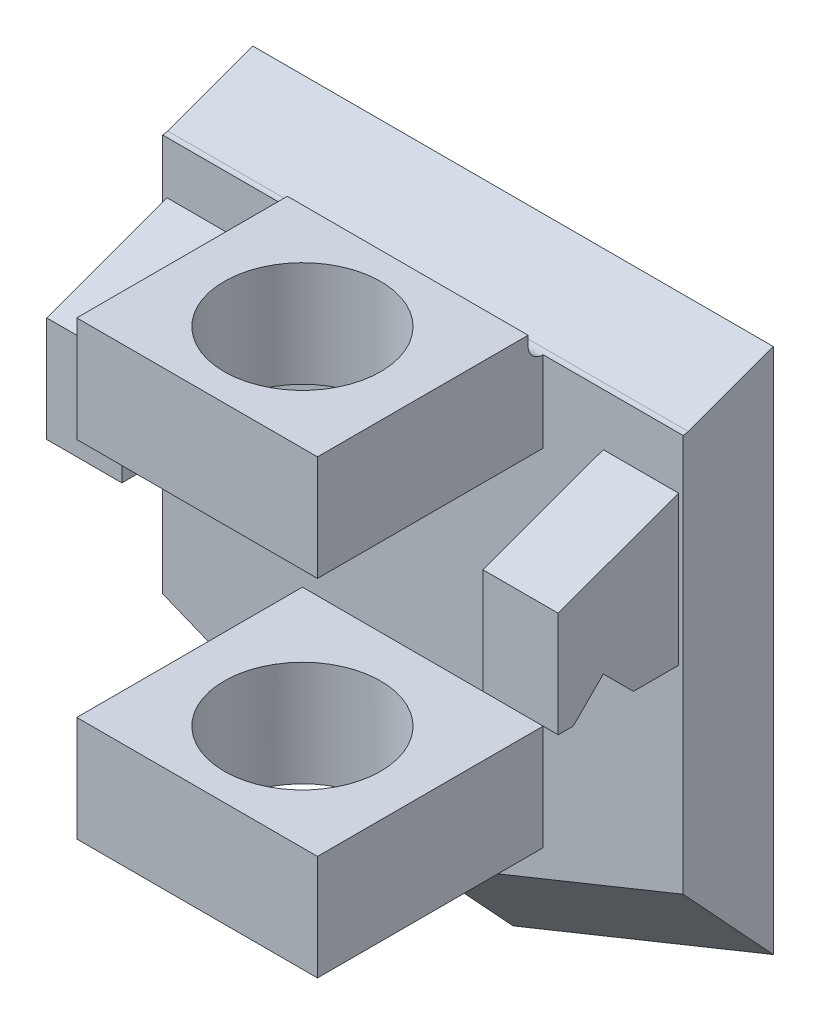
ISO-10303-21;
HEADER;
FILE_DESCRIPTION(('STEP AP214'),'2;1');
FILE_NAME('part.step','',(''),(''),'','','');
FILE_SCHEMA(('AUTOMOTIVE_DESIGN { 1 0 10303 214 1 1 1 1 }'));
ENDSEC;
DATA;
#1=APPLICATION_CONTEXT('core data for automotive mechanical design processes');
#2=APPLICATION_PROTOCOL_DEFINITION('international standard','automotive_design',2000,#1);
#3=PRODUCT_CONTEXT('',#1,'mechanical');
#4=PRODUCT('Part','Part','',(#3));
#5=PRODUCT_RELATED_PRODUCT_CATEGORY('part','',(#4));
#6=PRODUCT_DEFINITION_FORMATION('','',#4);
#7=PRODUCT_DEFINITION_CONTEXT('part definition',#1,'design');
#8=PRODUCT_DEFINITION('design','',#6,#7);
#9=PRODUCT_DEFINITION_SHAPE('','',#8);
#10=(LENGTH_UNIT() NAMED_UNIT(*) SI_UNIT(.MILLI.,.METRE.));
#11=(NAMED_UNIT(*) PLANE_ANGLE_UNIT() SI_UNIT($,.RADIAN.));
#12=(NAMED_UNIT(*) SI_UNIT($,.STERADIAN.) SOLID_ANGLE_UNIT());
#13=UNCERTAINTY_MEASURE_WITH_UNIT(LENGTH_MEASURE(1.E-05),#10,'distance_accuracy_value','');
#14=(GEOMETRIC_REPRESENTATION_CONTEXT(3) GLOBAL_UNCERTAINTY_ASSIGNED_CONTEXT((#13)) GLOBAL_UNIT_ASSIGNED_CONTEXT((#10,
#11,#12)) REPRESENTATION_CONTEXT('',''));
#15=CARTESIAN_POINT('',(0.,0.,0.));
#16=DIRECTION('',(0.,0.,1.));
#17=DIRECTION('',(1.,0.,0.));
#18=AXIS2_PLACEMENT_3D('',#15,#16,#17);
#19=CARTESIAN_POINT('',(8.,-15.,7.));
#20=DIRECTION('',(1.,0.,0.));
#21=DIRECTION('',(0.,0.,-1.));
#22=AXIS2_PLACEMENT_3D('',#19,#20,#21);
#23=PLANE('',#22);
#24=DIRECTION('',(0.,0.,1.));
#25=VECTOR('',#24,1.);
#26=CARTESIAN_POINT('',(8.,8.,7.));
#27=LINE('',#26,#25);
#28=CARTESIAN_POINT('',(8.,8.,6.));
#29=VERTEX_POINT('',#28);
#30=CARTESIAN_POINT('',(8.,8.,21.));
#31=VERTEX_POINT('',#30);
#32=EDGE_CURVE('E365',#29,#31,#27,.T.);
#33=ORIENTED_EDGE('',*,*,#32,.F.);
#34=DIRECTION('',(0.,-1.,0.));
#35=VECTOR('',#34,1.);
#36=CARTESIAN_POINT('',(8.,18.8455401467706,6.));
#37=LINE('',#36,#35);
#38=CARTESIAN_POINT('',(8.,13.3803563668787,6.));
#39=VERTEX_POINT('',#38);
#40=EDGE_CURVE('E258',#39,#29,#37,.T.);
#41=ORIENTED_EDGE('',*,*,#40,.F.);
#42=CARTESIAN_POINT('',(8.,14.3803563668787,6.));
#43=DIRECTION('',(1.,0.,0.));
#44=DIRECTION('',(0.,0.,-1.));
#45=AXIS2_PLACEMENT_3D('',#42,#43,#44);
#46=CIRCLE('',#45,1.);
#47=CARTESIAN_POINT('',(8.,14.3803563668787,7.));
#48=VERTEX_POINT('',#47);
#49=EDGE_CURVE('E11',#39,#48,#46,.F.);
#50=ORIENTED_EDGE('',*,*,#49,.T.);
#51=DIRECTION('',(0.,1.,0.));
#52=VECTOR('',#51,1.);
#53=CARTESIAN_POINT('',(8.,-15.,7.));
#54=LINE('',#53,#52);
#55=CARTESIAN_POINT('',(8.,15.,7.));
#56=VERTEX_POINT('',#55);
#57=EDGE_CURVE('E304',#48,#56,#54,.T.);
#58=ORIENTED_EDGE('',*,*,#57,.T.);
#59=DIRECTION('',(0.,0.,-1.));
#60=VECTOR('',#59,1.);
#61=CARTESIAN_POINT('',(8.,15.,7.));
#62=LINE('',#61,#60);
#63=CARTESIAN_POINT('',(8.,15.,21.));
#64=VERTEX_POINT('',#63);
#65=EDGE_CURVE('E290',#64,#56,#62,.T.);
#66=ORIENTED_EDGE('',*,*,#65,.F.);
#67=DIRECTION('',(0.,1.,0.));
#68=VECTOR('',#67,1.);
#69=CARTESIAN_POINT('',(8.,-15.,21.));
#70=LINE('',#69,#68);
#71=EDGE_CURVE('E309',#31,#64,#70,.T.);
#72=ORIENTED_EDGE('',*,*,#71,.F.);
#73=EDGE_LOOP('',(#33,#41,#50,#58,#66,#72));
#74=FACE_BOUND('',#73,.T.);
#75=ADVANCED_FACE('F35',(#74),#23,.T.);
#76=CARTESIAN_POINT('',(-8.,-15.,21.));
#77=DIRECTION('',(0.,0.,1.));
#78=DIRECTION('',(1.,0.,0.));
#79=AXIS2_PLACEMENT_3D('',#76,#77,#78);
#80=PLANE('',#79);
#81=DIRECTION('',(-1.,0.,0.));
#82=VECTOR('',#81,1.);
#83=CARTESIAN_POINT('',(-9.70663488308878,8.,21.));
#84=LINE('',#83,#82);
#85=CARTESIAN_POINT('',(-8.,8.,21.));
#86=VERTEX_POINT('',#85);
#87=EDGE_CURVE('E591',#31,#86,#84,.T.);
#88=ORIENTED_EDGE('',*,*,#87,.F.);
#89=ORIENTED_EDGE('',*,*,#71,.T.);
#90=DIRECTION('',(1.,0.,0.));
#91=VECTOR('',#90,1.);
#92=CARTESIAN_POINT('',(-8.,15.,21.));
#93=LINE('',#92,#91);
#94=CARTESIAN_POINT('',(-8.,15.,21.));
#95=VERTEX_POINT('',#94);
#96=EDGE_CURVE('E287',#95,#64,#93,.T.);
#97=ORIENTED_EDGE('',*,*,#96,.F.);
#98=DIRECTION('',(0.,1.,0.));
#99=VECTOR('',#98,1.);
#100=CARTESIAN_POINT('',(-8.,-15.,21.));
#101=LINE('',#100,#99);
#102=EDGE_CURVE('E313',#86,#95,#101,.T.);
#103=ORIENTED_EDGE('',*,*,#102,.F.);
#104=EDGE_LOOP('',(#88,#89,#97,#103));
#105=FACE_BOUND('',#104,.T.);
#106=ADVANCED_FACE('F511',(#105),#80,.T.);
#107=CARTESIAN_POINT('',(-8.,-15.,7.));
#108=DIRECTION('',(-1.,0.,0.));
#109=DIRECTION('',(0.,0.,1.));
#110=AXIS2_PLACEMENT_3D('',#107,#108,#109);
#111=PLANE('',#110);
#112=DIRECTION('',(0.,0.,-1.));
#113=VECTOR('',#112,1.);
#114=CARTESIAN_POINT('',(-8.,8.,7.));
#115=LINE('',#114,#113);
#116=CARTESIAN_POINT('',(-8.,8.,6.));
#117=VERTEX_POINT('',#116);
#118=EDGE_CURVE('E363',#86,#117,#115,.T.);
#119=ORIENTED_EDGE('',*,*,#118,.F.);
#120=ORIENTED_EDGE('',*,*,#102,.T.);
#121=DIRECTION('',(0.,0.,1.));
#122=VECTOR('',#121,1.);
#123=CARTESIAN_POINT('',(-8.,15.,7.));
#124=LINE('',#123,#122);
#125=CARTESIAN_POINT('',(-8.,15.,7.));
#126=VERTEX_POINT('',#125);
#127=EDGE_CURVE('E284',#126,#95,#124,.T.);
#128=ORIENTED_EDGE('',*,*,#127,.F.);
#129=DIRECTION('',(0.,1.,0.));
#130=VECTOR('',#129,1.);
#131=CARTESIAN_POINT('',(-8.,-15.,7.));
#132=LINE('',#131,#130);
#133=CARTESIAN_POINT('',(-8.,14.3803563668787,7.));
#134=VERTEX_POINT('',#133);
#135=EDGE_CURVE('E303',#134,#126,#132,.T.);
#136=ORIENTED_EDGE('',*,*,#135,.F.);
#137=CARTESIAN_POINT('',(-8.,14.3803563668787,6.));
#138=DIRECTION('',(-1.,0.,0.));
#139=DIRECTION('',(0.,0.,1.));
#140=AXIS2_PLACEMENT_3D('',#137,#138,#139);
#141=CIRCLE('',#140,1.);
#142=CARTESIAN_POINT('',(-8.,13.3803563668787,6.));
#143=VERTEX_POINT('',#142);
#144=EDGE_CURVE('E345',#134,#143,#141,.F.);
#145=ORIENTED_EDGE('',*,*,#144,.T.);
#146=DIRECTION('',(0.,1.,0.));
#147=VECTOR('',#146,1.);
#148=CARTESIAN_POINT('',(-8.,-15.,6.));
#149=LINE('',#148,#147);
#150=EDGE_CURVE('E268',#117,#143,#149,.T.);
#151=ORIENTED_EDGE('',*,*,#150,.F.);
#152=EDGE_LOOP('',(#119,#120,#128,#136,#145,#151));
#153=FACE_BOUND('',#152,.T.);
#154=ADVANCED_FACE('F518',(#153),#111,.T.);
#155=CARTESIAN_POINT('',(0.,-15.,14.));
#156=DIRECTION('',(0.,1.,0.));
#157=DIRECTION('',(0.,0.,1.));
#158=AXIS2_PLACEMENT_3D('',#155,#156,#157);
#159=CYLINDRICAL_SURFACE('',#158,5.2);
#160=CARTESIAN_POINT('',(0.,8.,14.));
#161=DIRECTION('',(0.,1.,0.));
#162=DIRECTION('',(0.,0.,1.));
#163=AXIS2_PLACEMENT_3D('',#160,#161,#162);
#164=CIRCLE('',#163,5.2);
#165=CARTESIAN_POINT('',(0.,8.,19.2));
#166=VERTEX_POINT('',#165);
#167=EDGE_CURVE('E39',#166,#166,#164,.F.);
#168=ORIENTED_EDGE('',*,*,#167,.T.);
#169=EDGE_LOOP('',(#168));
#170=FACE_BOUND('',#169,.T.);
#171=CARTESIAN_POINT('',(0.,15.,14.));
#172=DIRECTION('',(0.,1.,0.));
#173=DIRECTION('',(0.,0.,1.));
#174=AXIS2_PLACEMENT_3D('',#171,#172,#173);
#175=CIRCLE('',#174,5.2);
#176=CARTESIAN_POINT('',(0.,15.,19.2));
#177=VERTEX_POINT('',#176);
#178=EDGE_CURVE('E278',#177,#177,#175,.T.);
#179=ORIENTED_EDGE('',*,*,#178,.T.);
#180=EDGE_LOOP('',(#179));
#181=FACE_BOUND('',#180,.T.);
#182=ADVANCED_FACE('F611',(#170,#181),#159,.F.);
#183=CARTESIAN_POINT('',(0.,0.,6.));
#184=DIRECTION('',(0.,0.,-1.));
#185=DIRECTION('',(-1.,0.,0.));
#186=AXIS2_PLACEMENT_3D('',#183,#184,#185);
#187=PLANE('',#186);
#188=DIRECTION('',(-1.,0.,0.));
#189=VECTOR('',#188,1.);
#190=CARTESIAN_POINT('',(-9.70663488308878,8.,6.));
#191=LINE('',#190,#189);
#192=EDGE_CURVE('E252',#29,#117,#191,.T.);
#193=ORIENTED_EDGE('',*,*,#192,.T.);
#194=ORIENTED_EDGE('',*,*,#150,.T.);
#195=DIRECTION('',(-1.,0.,0.));
#196=VECTOR('',#195,1.);
#197=CARTESIAN_POINT('',(-8.,13.3803563668787,6.));
#198=LINE('',#197,#196);
#199=CARTESIAN_POINT('',(-17.3,13.3803563668787,6.));
#200=VERTEX_POINT('',#199);
#201=EDGE_CURVE('E348',#143,#200,#198,.T.);
#202=ORIENTED_EDGE('',*,*,#201,.T.);
#203=DIRECTION('',(0.,-1.,0.));
#204=VECTOR('',#203,1.);
#205=CARTESIAN_POINT('',(-17.3,18.8455401467706,6.));
#206=LINE('',#205,#204);
#207=CARTESIAN_POINT('',(-17.3,-13.0274464843724,6.));
#208=VERTEX_POINT('',#207);
#209=EDGE_CURVE('E270',#200,#208,#206,.T.);
#210=ORIENTED_EDGE('',*,*,#209,.T.);
#211=DIRECTION('',(-0.926991176745522,0.375083135099344,0.));
#212=VECTOR('',#211,1.);
#213=CARTESIAN_POINT('',(2.25049881059607,-20.9380529395268,6.));
#214=LINE('',#213,#212);
#215=CARTESIAN_POINT('',(0.,-20.0274464843724,6.));
#216=VERTEX_POINT('',#215);
#217=EDGE_CURVE('E276',#208,#216,#214,.F.);
#218=ORIENTED_EDGE('',*,*,#217,.T.);
#219=DIRECTION('',(-0.926991176745522,-0.375083135099344,0.));
#220=VECTOR('',#219,1.);
#221=CARTESIAN_POINT('',(15.0495011894039,-13.9380529395268,6.));
#222=LINE('',#221,#220);
#223=CARTESIAN_POINT('',(17.3,-13.0274464843724,6.));
#224=VERTEX_POINT('',#223);
#225=EDGE_CURVE('E274',#216,#224,#222,.F.);
#226=ORIENTED_EDGE('',*,*,#225,.T.);
#227=DIRECTION('',(0.,1.,0.));
#228=VECTOR('',#227,1.);
#229=CARTESIAN_POINT('',(17.3,-21.2473782042721,6.));
#230=LINE('',#229,#228);
#231=CARTESIAN_POINT('',(17.3,13.3803563668787,6.));
#232=VERTEX_POINT('',#231);
#233=EDGE_CURVE('E272',#224,#232,#230,.T.);
#234=ORIENTED_EDGE('',*,*,#233,.T.);
#235=DIRECTION('',(-1.,0.,0.));
#236=VECTOR('',#235,1.);
#237=CARTESIAN_POINT('',(17.3,13.3803563668787,6.));
#238=LINE('',#237,#236);
#239=EDGE_CURVE('E44',#232,#39,#238,.T.);
#240=ORIENTED_EDGE('',*,*,#239,.T.);
#241=ORIENTED_EDGE('',*,*,#40,.T.);
#242=EDGE_LOOP('',(#193,#194,#202,#210,#218,#226,#234,#240,#241));
#243=FACE_BOUND('',#242,.T.);
#244=DIRECTION('',(1.,0.,0.));
#245=VECTOR('',#244,1.);
#246=CARTESIAN_POINT('',(-9.70663488308878,-8.,6.));
#247=LINE('',#246,#245);
#248=CARTESIAN_POINT('',(-8.,-8.,6.));
#249=VERTEX_POINT('',#248);
#250=CARTESIAN_POINT('',(8.,-8.,6.));
#251=VERTEX_POINT('',#250);
#252=EDGE_CURVE('E52',#249,#251,#247,.T.);
#253=ORIENTED_EDGE('',*,*,#252,.T.);
#254=CARTESIAN_POINT('',(8.,-15.,6.));
#255=VERTEX_POINT('',#254);
#256=EDGE_CURVE('E247',#251,#255,#37,.T.);
#257=ORIENTED_EDGE('',*,*,#256,.T.);
#258=DIRECTION('',(-1.,0.,0.));
#259=VECTOR('',#258,1.);
#260=CARTESIAN_POINT('',(8.,-15.,6.));
#261=LINE('',#260,#259);
#262=CARTESIAN_POINT('',(-8.,-15.,6.));
#263=VERTEX_POINT('',#262);
#264=EDGE_CURVE('E262',#255,#263,#261,.T.);
#265=ORIENTED_EDGE('',*,*,#264,.T.);
#266=EDGE_CURVE('E250',#263,#249,#149,.T.);
#267=ORIENTED_EDGE('',*,*,#266,.T.);
#268=EDGE_LOOP('',(#253,#257,#265,#267));
#269=FACE_BOUND('',#268,.T.);
#270=DIRECTION('',(0.,1.,0.));
#271=VECTOR('',#270,1.);
#272=CARTESIAN_POINT('',(17.,0.,6.));
#273=LINE('',#272,#271);
#274=CARTESIAN_POINT('',(17.,0.,6.));
#275=VERTEX_POINT('',#274);
#276=CARTESIAN_POINT('',(17.,9.91176187412966,6.));
#277=VERTEX_POINT('',#276);
#278=EDGE_CURVE('E421',#275,#277,#273,.T.);
#279=ORIENTED_EDGE('',*,*,#278,.F.);
#280=DIRECTION('',(-1.,0.,0.));
#281=VECTOR('',#280,1.);
#282=CARTESIAN_POINT('',(17.,0.,6.));
#283=LINE('',#282,#281);
#284=CARTESIAN_POINT('',(12.,0.,6.));
#285=VERTEX_POINT('',#284);
#286=EDGE_CURVE('E437',#275,#285,#283,.T.);
#287=ORIENTED_EDGE('',*,*,#286,.T.);
#288=DIRECTION('',(0.,1.,0.));
#289=VECTOR('',#288,1.);
#290=CARTESIAN_POINT('',(12.,0.,6.));
#291=LINE('',#290,#289);
#292=CARTESIAN_POINT('',(12.,9.91176187412966,6.));
#293=VERTEX_POINT('',#292);
#294=EDGE_CURVE('E420',#285,#293,#291,.T.);
#295=ORIENTED_EDGE('',*,*,#294,.T.);
#296=DIRECTION('',(-1.,0.,0.));
#297=VECTOR('',#296,1.);
#298=CARTESIAN_POINT('',(17.,9.91176187412966,6.));
#299=LINE('',#298,#297);
#300=EDGE_CURVE('E259',#277,#293,#299,.T.);
#301=ORIENTED_EDGE('',*,*,#300,.F.);
#302=EDGE_LOOP('',(#279,#287,#295,#301));
#303=FACE_BOUND('',#302,.T.);
#304=DIRECTION('',(0.,1.,0.));
#305=VECTOR('',#304,1.);
#306=CARTESIAN_POINT('',(-17.,0.,6.));
#307=LINE('',#306,#305);
#308=CARTESIAN_POINT('',(-17.,0.,6.));
#309=VERTEX_POINT('',#308);
#310=CARTESIAN_POINT('',(-17.,9.91176187412966,6.));
#311=VERTEX_POINT('',#310);
#312=EDGE_CURVE('E368',#309,#311,#307,.T.);
#313=ORIENTED_EDGE('',*,*,#312,.T.);
#314=DIRECTION('',(1.,0.,0.));
#315=VECTOR('',#314,1.);
#316=CARTESIAN_POINT('',(-17.,9.91176187412966,6.));
#317=LINE('',#316,#315);
#318=CARTESIAN_POINT('',(-12.,9.91176187412966,6.));
#319=VERTEX_POINT('',#318);
#320=EDGE_CURVE('E390',#311,#319,#317,.T.);
#321=ORIENTED_EDGE('',*,*,#320,.T.);
#322=DIRECTION('',(0.,1.,0.));
#323=VECTOR('',#322,1.);
#324=CARTESIAN_POINT('',(-12.,0.,6.));
#325=LINE('',#324,#323);
#326=CARTESIAN_POINT('',(-12.,0.,6.));
#327=VERTEX_POINT('',#326);
#328=EDGE_CURVE('E367',#327,#319,#325,.T.);
#329=ORIENTED_EDGE('',*,*,#328,.F.);
#330=DIRECTION('',(1.,0.,0.));
#331=VECTOR('',#330,1.);
#332=CARTESIAN_POINT('',(-17.,0.,6.));
#333=LINE('',#332,#331);
#334=EDGE_CURVE('E418',#309,#327,#333,.T.);
#335=ORIENTED_EDGE('',*,*,#334,.F.);
#336=EDGE_LOOP('',(#313,#321,#329,#335));
#337=FACE_BOUND('',#336,.T.);
#338=ADVANCED_FACE('F244',(#243,#269,#303,#337),#187,.F.);
#339=CARTESIAN_POINT('',(17.3,13.,7.));
#340=DIRECTION('',(-1.,0.,0.));
#341=DIRECTION('',(0.,0.,1.));
#342=AXIS2_PLACEMENT_3D('',#339,#340,#341);
#343=PLANE('',#342);
#344=DIRECTION('',(0.,0.342020143325666,-0.939692620785909));
#345=VECTOR('',#344,1.);
#346=CARTESIAN_POINT('',(17.3,15.5,0.));
#347=LINE('',#346,#345);
#348=CARTESIAN_POINT('',(17.3,15.5,0.));
#349=VERTEX_POINT('',#348);
#350=CARTESIAN_POINT('',(17.3,13.4406637460928,5.65797985667433));
#351=VERTEX_POINT('',#350);
#352=EDGE_CURVE('E334',#349,#351,#347,.F.);
#353=ORIENTED_EDGE('',*,*,#352,.T.);
#354=CARTESIAN_POINT('',(17.3,14.3803563668787,6.));
#355=DIRECTION('',(-1.,0.,0.));
#356=DIRECTION('',(0.,0.,1.));
#357=AXIS2_PLACEMENT_3D('',#354,#355,#356);
#358=CIRCLE('',#357,1.);
#359=EDGE_CURVE('E353',#351,#232,#358,.T.);
#360=ORIENTED_EDGE('',*,*,#359,.T.);
#361=ORIENTED_EDGE('',*,*,#233,.F.);
#362=DIRECTION('',(0.,0.733371095333155,0.679828534654032));
#363=VECTOR('',#362,1.);
#364=CARTESIAN_POINT('',(17.3,-19.5,0.));
#365=LINE('',#364,#363);
#366=CARTESIAN_POINT('',(17.3,-19.5,0.));
#367=VERTEX_POINT('',#366);
#368=EDGE_CURVE('E329',#224,#367,#365,.F.);
#369=ORIENTED_EDGE('',*,*,#368,.T.);
#370=DIRECTION('',(0.,1.,0.));
#371=VECTOR('',#370,1.);
#372=CARTESIAN_POINT('',(17.3,13.,0.));
#373=LINE('',#372,#371);
#374=EDGE_CURVE('E324',#367,#349,#373,.T.);
#375=ORIENTED_EDGE('',*,*,#374,.T.);
#376=EDGE_LOOP('',(#353,#360,#361,#369,#375));
#377=FACE_BOUND('',#376,.T.);
#378=ADVANCED_FACE('F552',(#377),#343,.F.);
#379=CARTESIAN_POINT('',(-17.3,13.,7.));
#380=DIRECTION('',(1.,0.,0.));
#381=DIRECTION('',(0.,1.,0.));
#382=AXIS2_PLACEMENT_3D('',#379,#380,#381);
#383=PLANE('',#382);
#384=DIRECTION('',(0.,-0.733371095333155,-0.679828534654032));
#385=VECTOR('',#384,1.);
#386=CARTESIAN_POINT('',(-17.3,-23.2648321442911,-3.48996617968573));
#387=LINE('',#386,#385);
#388=CARTESIAN_POINT('',(-17.3,-19.5,0.));
#389=VERTEX_POINT('',#388);
#390=EDGE_CURVE('E331',#389,#208,#387,.F.);
#391=ORIENTED_EDGE('',*,*,#390,.T.);
#392=ORIENTED_EDGE('',*,*,#209,.F.);
#393=CARTESIAN_POINT('',(-17.3,14.3803563668787,6.));
#394=DIRECTION('',(1.,0.,0.));
#395=DIRECTION('',(0.,1.,0.));
#396=AXIS2_PLACEMENT_3D('',#393,#394,#395);
#397=CIRCLE('',#396,1.);
#398=CARTESIAN_POINT('',(-17.3,13.4406637460928,5.65797985667433));
#399=VERTEX_POINT('',#398);
#400=EDGE_CURVE('E351',#200,#399,#397,.T.);
#401=ORIENTED_EDGE('',*,*,#400,.T.);
#402=DIRECTION('',(0.,-0.342020143325666,0.939692620785909));
#403=VECTOR('',#402,1.);
#404=CARTESIAN_POINT('',(-17.3,15.5,0.));
#405=LINE('',#404,#403);
#406=CARTESIAN_POINT('',(-17.3,15.5,0.));
#407=VERTEX_POINT('',#406);
#408=EDGE_CURVE('E338',#399,#407,#405,.F.);
#409=ORIENTED_EDGE('',*,*,#408,.T.);
#410=DIRECTION('',(0.,-1.,0.));
#411=VECTOR('',#410,1.);
#412=CARTESIAN_POINT('',(-17.3,13.,0.));
#413=LINE('',#412,#411);
#414=EDGE_CURVE('E327',#407,#389,#413,.T.);
#415=ORIENTED_EDGE('',*,*,#414,.T.);
#416=EDGE_LOOP('',(#391,#392,#401,#409,#415));
#417=FACE_BOUND('',#416,.T.);
#418=ADVANCED_FACE('F548',(#417),#383,.F.);
#419=CARTESIAN_POINT('',(0.,0.,0.));
#420=DIRECTION('',(0.,0.,1.));
#421=DIRECTION('',(1.,0.,0.));
#422=AXIS2_PLACEMENT_3D('',#419,#420,#421);
#423=PLANE('',#422);
#424=ORIENTED_EDGE('',*,*,#374,.F.);
#425=DIRECTION('',(-0.926991176745522,-0.375083135099344,0.));
#426=VECTOR('',#425,1.);
#427=CARTESIAN_POINT('',(17.3,-19.5,0.));
#428=LINE('',#427,#426);
#429=CARTESIAN_POINT('',(0.,-26.5,0.));
#430=VERTEX_POINT('',#429);
#431=EDGE_CURVE('E319',#367,#430,#428,.T.);
#432=ORIENTED_EDGE('',*,*,#431,.T.);
#433=DIRECTION('',(-0.926991176745522,0.375083135099344,0.));
#434=VECTOR('',#433,1.);
#435=CARTESIAN_POINT('',(0.,-26.5,0.));
#436=LINE('',#435,#434);
#437=EDGE_CURVE('E315',#430,#389,#436,.T.);
#438=ORIENTED_EDGE('',*,*,#437,.T.);
#439=ORIENTED_EDGE('',*,*,#414,.F.);
#440=DIRECTION('',(1.,0.,0.));
#441=VECTOR('',#440,1.);
#442=CARTESIAN_POINT('',(17.3,15.5,0.));
#443=LINE('',#442,#441);
#444=EDGE_CURVE('E318',#407,#349,#443,.T.);
#445=ORIENTED_EDGE('',*,*,#444,.T.);
#446=EDGE_LOOP('',(#424,#432,#438,#439,#445));
#447=FACE_BOUND('',#446,.T.);
#448=ADVANCED_FACE('F544',(#447),#423,.F.);
#449=CARTESIAN_POINT('',(0.,-26.5,0.));
#450=DIRECTION('',(0.265223828337456,0.655481747176855,-0.707106781186549));
#451=DIRECTION('',(-0.926991176745522,0.375083135099344,0.));
#452=AXIS2_PLACEMENT_3D('',#449,#450,#451);
#453=PLANE('',#452);
#454=ORIENTED_EDGE('',*,*,#217,.F.);
#455=ORIENTED_EDGE('',*,*,#390,.F.);
#456=ORIENTED_EDGE('',*,*,#437,.F.);
#457=DIRECTION('',(0.,0.733371095333155,0.679828534654032));
#458=VECTOR('',#457,1.);
#459=CARTESIAN_POINT('',(0.,-26.5,0.));
#460=LINE('',#459,#458);
#461=EDGE_CURVE('E306',#216,#430,#460,.F.);
#462=ORIENTED_EDGE('',*,*,#461,.F.);
#463=EDGE_LOOP('',(#454,#455,#456,#462));
#464=FACE_BOUND('',#463,.T.);
#465=ADVANCED_FACE('F547',(#464),#453,.F.);
#466=CARTESIAN_POINT('',(17.3,-19.5,0.));
#467=DIRECTION('',(-0.265223828337456,0.655481747176855,-0.707106781186549));
#468=DIRECTION('',(-0.926991176745522,-0.375083135099344,0.));
#469=AXIS2_PLACEMENT_3D('',#466,#467,#468);
#470=PLANE('',#469);
#471=ORIENTED_EDGE('',*,*,#225,.F.);
#472=ORIENTED_EDGE('',*,*,#461,.T.);
#473=ORIENTED_EDGE('',*,*,#431,.F.);
#474=ORIENTED_EDGE('',*,*,#368,.F.);
#475=EDGE_LOOP('',(#471,#472,#473,#474));
#476=FACE_BOUND('',#475,.T.);
#477=ADVANCED_FACE('F539',(#476),#470,.F.);
#478=CARTESIAN_POINT('',(17.3,15.5,0.));
#479=DIRECTION('',(0.,-0.939692620785909,-0.342020143325666));
#480=DIRECTION('',(1.,0.,0.));
#481=AXIS2_PLACEMENT_3D('',#478,#479,#480);
#482=PLANE('',#481);
#483=ORIENTED_EDGE('',*,*,#408,.F.);
#484=DIRECTION('',(-1.,0.,0.));
#485=VECTOR('',#484,1.);
#486=CARTESIAN_POINT('',(8.,13.4406637460928,5.65797985667433));
#487=LINE('',#486,#485);
#488=EDGE_CURVE('E343',#399,#351,#487,.F.);
#489=ORIENTED_EDGE('',*,*,#488,.T.);
#490=ORIENTED_EDGE('',*,*,#352,.F.);
#491=ORIENTED_EDGE('',*,*,#444,.F.);
#492=EDGE_LOOP('',(#483,#489,#490,#491));
#493=FACE_BOUND('',#492,.T.);
#494=ADVANCED_FACE('F533',(#493),#482,.F.);
#495=CARTESIAN_POINT('',(-8.,-15.,7.));
#496=DIRECTION('',(0.,0.,-1.));
#497=DIRECTION('',(-1.,0.,0.));
#498=AXIS2_PLACEMENT_3D('',#495,#496,#497);
#499=PLANE('',#498);
#500=ORIENTED_EDGE('',*,*,#57,.F.);
#501=DIRECTION('',(1.,0.,0.));
#502=VECTOR('',#501,1.);
#503=CARTESIAN_POINT('',(-8.,14.3803563668787,7.));
#504=LINE('',#503,#502);
#505=EDGE_CURVE('E340',#48,#134,#504,.F.);
#506=ORIENTED_EDGE('',*,*,#505,.T.);
#507=ORIENTED_EDGE('',*,*,#135,.T.);
#508=DIRECTION('',(-1.,0.,0.));
#509=VECTOR('',#508,1.);
#510=CARTESIAN_POINT('',(-8.,15.,7.));
#511=LINE('',#510,#509);
#512=EDGE_CURVE('E281',#56,#126,#511,.T.);
#513=ORIENTED_EDGE('',*,*,#512,.F.);
#514=EDGE_LOOP('',(#500,#506,#507,#513));
#515=FACE_BOUND('',#514,.T.);
#516=ADVANCED_FACE('F525',(#515),#499,.T.);
#517=DIRECTION('',(0.,0.,-1.));
#518=VECTOR('',#517,1.);
#519=CARTESIAN_POINT('',(8.,-8.,7.));
#520=LINE('',#519,#518);
#521=CARTESIAN_POINT('',(8.,-8.,21.));
#522=VERTEX_POINT('',#521);
#523=EDGE_CURVE('E232',#522,#251,#520,.T.);
#524=ORIENTED_EDGE('',*,*,#523,.F.);
#525=CARTESIAN_POINT('',(8.,-15.,21.));
#526=VERTEX_POINT('',#525);
#527=EDGE_CURVE('E307',#526,#522,#70,.T.);
#528=ORIENTED_EDGE('',*,*,#527,.F.);
#529=DIRECTION('',(0.,0.,-1.));
#530=VECTOR('',#529,1.);
#531=CARTESIAN_POINT('',(8.,-15.,7.));
#532=LINE('',#531,#530);
#533=EDGE_CURVE('E256',#526,#255,#532,.T.);
#534=ORIENTED_EDGE('',*,*,#533,.T.);
#535=ORIENTED_EDGE('',*,*,#256,.F.);
#536=EDGE_LOOP('',(#524,#528,#534,#535));
#537=FACE_BOUND('',#536,.T.);
#538=ADVANCED_FACE('F254',(#537),#23,.T.);
#539=DIRECTION('',(1.,0.,0.));
#540=VECTOR('',#539,1.);
#541=CARTESIAN_POINT('',(-9.70663488308878,-8.,21.));
#542=LINE('',#541,#540);
#543=CARTESIAN_POINT('',(-8.,-8.,21.));
#544=VERTEX_POINT('',#543);
#545=EDGE_CURVE('E236',#544,#522,#542,.T.);
#546=ORIENTED_EDGE('',*,*,#545,.F.);
#547=CARTESIAN_POINT('',(-8.,-15.,21.));
#548=VERTEX_POINT('',#547);
#549=EDGE_CURVE('E310',#548,#544,#101,.T.);
#550=ORIENTED_EDGE('',*,*,#549,.F.);
#551=DIRECTION('',(1.,0.,0.));
#552=VECTOR('',#551,1.);
#553=CARTESIAN_POINT('',(-8.,-15.,21.));
#554=LINE('',#553,#552);
#555=EDGE_CURVE('E299',#548,#526,#554,.T.);
#556=ORIENTED_EDGE('',*,*,#555,.T.);
#557=ORIENTED_EDGE('',*,*,#527,.T.);
#558=EDGE_LOOP('',(#546,#550,#556,#557));
#559=FACE_BOUND('',#558,.T.);
#560=ADVANCED_FACE('F521',(#559),#80,.T.);
#561=DIRECTION('',(0.,0.,1.));
#562=VECTOR('',#561,1.);
#563=CARTESIAN_POINT('',(-8.,-8.,7.));
#564=LINE('',#563,#562);
#565=EDGE_CURVE('E240',#249,#544,#564,.T.);
#566=ORIENTED_EDGE('',*,*,#565,.F.);
#567=ORIENTED_EDGE('',*,*,#266,.F.);
#568=DIRECTION('',(0.,0.,1.));
#569=VECTOR('',#568,1.);
#570=CARTESIAN_POINT('',(-8.,-15.,7.));
#571=LINE('',#570,#569);
#572=EDGE_CURVE('E296',#263,#548,#571,.T.);
#573=ORIENTED_EDGE('',*,*,#572,.T.);
#574=ORIENTED_EDGE('',*,*,#549,.T.);
#575=EDGE_LOOP('',(#566,#567,#573,#574));
#576=FACE_BOUND('',#575,.T.);
#577=ADVANCED_FACE('F530',(#576),#111,.T.);
#578=CARTESIAN_POINT('',(0.,-15.,0.));
#579=DIRECTION('',(0.,-1.,0.));
#580=DIRECTION('',(0.,0.,-1.));
#581=AXIS2_PLACEMENT_3D('',#578,#579,#580);
#582=PLANE('',#581);
#583=CARTESIAN_POINT('',(0.,-15.,14.));
#584=DIRECTION('',(0.,1.,0.));
#585=DIRECTION('',(0.,0.,1.));
#586=AXIS2_PLACEMENT_3D('',#583,#584,#585);
#587=CIRCLE('',#586,5.2);
#588=CARTESIAN_POINT('',(0.,-15.,19.2));
#589=VERTEX_POINT('',#588);
#590=EDGE_CURVE('E293',#589,#589,#587,.T.);
#591=ORIENTED_EDGE('',*,*,#590,.T.);
#592=EDGE_LOOP('',(#591));
#593=FACE_BOUND('',#592,.T.);
#594=ORIENTED_EDGE('',*,*,#572,.F.);
#595=ORIENTED_EDGE('',*,*,#264,.F.);
#596=ORIENTED_EDGE('',*,*,#533,.F.);
#597=ORIENTED_EDGE('',*,*,#555,.F.);
#598=EDGE_LOOP('',(#594,#595,#596,#597));
#599=FACE_BOUND('',#598,.T.);
#600=ADVANCED_FACE('F622',(#593,#599),#582,.T.);
#601=CARTESIAN_POINT('',(0.,-8.,14.));
#602=DIRECTION('',(0.,-1.,0.));
#603=DIRECTION('',(1.,0.,0.));
#604=AXIS2_PLACEMENT_3D('',#601,#602,#603);
#605=CIRCLE('',#604,5.2);
#606=CARTESIAN_POINT('',(5.2,-8.,14.));
#607=VERTEX_POINT('',#606);
#608=EDGE_CURVE('E251',#607,#607,#605,.F.);
#609=ORIENTED_EDGE('',*,*,#608,.T.);
#610=EDGE_LOOP('',(#609));
#611=FACE_BOUND('',#610,.T.);
#612=ORIENTED_EDGE('',*,*,#590,.F.);
#613=EDGE_LOOP('',(#612));
#614=FACE_BOUND('',#613,.T.);
#615=ADVANCED_FACE('F607',(#611,#614),#159,.F.);
#616=CARTESIAN_POINT('',(0.,15.,0.));
#617=DIRECTION('',(0.,-1.,0.));
#618=DIRECTION('',(0.,0.,-1.));
#619=AXIS2_PLACEMENT_3D('',#616,#617,#618);
#620=PLANE('',#619);
#621=ORIENTED_EDGE('',*,*,#512,.T.);
#622=ORIENTED_EDGE('',*,*,#127,.T.);
#623=ORIENTED_EDGE('',*,*,#96,.T.);
#624=ORIENTED_EDGE('',*,*,#65,.T.);
#625=EDGE_LOOP('',(#621,#622,#623,#624));
#626=FACE_BOUND('',#625,.T.);
#627=ORIENTED_EDGE('',*,*,#178,.F.);
#628=EDGE_LOOP('',(#627));
#629=FACE_BOUND('',#628,.T.);
#630=ADVANCED_FACE('F601',(#626,#629),#620,.F.);
#631=CARTESIAN_POINT('',(-8.,14.3803563668787,6.));
#632=DIRECTION('',(-1.,0.,0.));
#633=DIRECTION('',(0.,0.,1.));
#634=AXIS2_PLACEMENT_3D('',#631,#632,#633);
#635=CYLINDRICAL_SURFACE('',#634,1.);
#636=ORIENTED_EDGE('',*,*,#359,.F.);
#637=ORIENTED_EDGE('',*,*,#488,.F.);
#638=ORIENTED_EDGE('',*,*,#400,.F.);
#639=ORIENTED_EDGE('',*,*,#201,.F.);
#640=ORIENTED_EDGE('',*,*,#144,.F.);
#641=ORIENTED_EDGE('',*,*,#505,.F.);
#642=ORIENTED_EDGE('',*,*,#49,.F.);
#643=ORIENTED_EDGE('',*,*,#239,.F.);
#644=EDGE_LOOP('',(#636,#637,#638,#639,#640,#641,#642,#643));
#645=FACE_BOUND('',#644,.T.);
#646=ADVANCED_FACE('F37',(#645),#635,.F.);
#647=CARTESIAN_POINT('',(17.,9.91176187412966,6.));
#648=DIRECTION('',(0.,-0.939692620785907,-0.342020143325673));
#649=DIRECTION('',(0.,0.342020143325673,-0.939692620785907));
#650=AXIS2_PLACEMENT_3D('',#647,#648,#649);
#651=PLANE('',#650);
#652=DIRECTION('',(0.,-0.342020143325673,0.939692620785907));
#653=VECTOR('',#652,1.);
#654=CARTESIAN_POINT('',(12.,9.91176187412966,6.));
#655=LINE('',#654,#653);
#656=CARTESIAN_POINT('',(12.,7.,14.));
#657=VERTEX_POINT('',#656);
#658=EDGE_CURVE('E440',#293,#657,#655,.T.);
#659=ORIENTED_EDGE('',*,*,#658,.T.);
#660=DIRECTION('',(-1.,0.,0.));
#661=VECTOR('',#660,1.);
#662=CARTESIAN_POINT('',(17.,7.,14.));
#663=LINE('',#662,#661);
#664=CARTESIAN_POINT('',(17.,7.,14.));
#665=VERTEX_POINT('',#664);
#666=EDGE_CURVE('E263',#665,#657,#663,.T.);
#667=ORIENTED_EDGE('',*,*,#666,.F.);
#668=DIRECTION('',(0.,-0.342020143325673,0.939692620785907));
#669=VECTOR('',#668,1.);
#670=CARTESIAN_POINT('',(17.,9.91176187412966,6.));
#671=LINE('',#670,#669);
#672=EDGE_CURVE('E424',#277,#665,#671,.T.);
#673=ORIENTED_EDGE('',*,*,#672,.F.);
#674=ORIENTED_EDGE('',*,*,#300,.T.);
#675=EDGE_LOOP('',(#659,#667,#673,#674));
#676=FACE_BOUND('',#675,.T.);
#677=ADVANCED_FACE('F493',(#676),#651,.F.);
#678=CARTESIAN_POINT('',(17.,7.,14.));
#679=DIRECTION('',(0.,0.,-1.));
#680=DIRECTION('',(0.,1.,0.));
#681=AXIS2_PLACEMENT_3D('',#678,#679,#680);
#682=PLANE('',#681);
#683=DIRECTION('',(0.,-1.,0.));
#684=VECTOR('',#683,1.);
#685=CARTESIAN_POINT('',(12.,7.,14.));
#686=LINE('',#685,#684);
#687=CARTESIAN_POINT('',(12.,0.,14.));
#688=VERTEX_POINT('',#687);
#689=EDGE_CURVE('E442',#657,#688,#686,.T.);
#690=ORIENTED_EDGE('',*,*,#689,.T.);
#691=DIRECTION('',(-1.,0.,0.));
#692=VECTOR('',#691,1.);
#693=CARTESIAN_POINT('',(17.,0.,14.));
#694=LINE('',#693,#692);
#695=CARTESIAN_POINT('',(17.,0.,14.));
#696=VERTEX_POINT('',#695);
#697=EDGE_CURVE('E462',#696,#688,#694,.T.);
#698=ORIENTED_EDGE('',*,*,#697,.F.);
#699=DIRECTION('',(0.,-1.,0.));
#700=VECTOR('',#699,1.);
#701=CARTESIAN_POINT('',(17.,7.,14.));
#702=LINE('',#701,#700);
#703=EDGE_CURVE('E427',#665,#696,#702,.T.);
#704=ORIENTED_EDGE('',*,*,#703,.F.);
#705=ORIENTED_EDGE('',*,*,#666,.T.);
#706=EDGE_LOOP('',(#690,#698,#704,#705));
#707=FACE_BOUND('',#706,.T.);
#708=ADVANCED_FACE('F469',(#707),#682,.F.);
#709=CARTESIAN_POINT('',(17.,0.,14.));
#710=DIRECTION('',(0.,1.,0.));
#711=DIRECTION('',(0.,0.,1.));
#712=AXIS2_PLACEMENT_3D('',#709,#710,#711);
#713=PLANE('',#712);
#714=DIRECTION('',(0.,0.,-1.));
#715=VECTOR('',#714,1.);
#716=CARTESIAN_POINT('',(12.,0.,14.));
#717=LINE('',#716,#715);
#718=CARTESIAN_POINT('',(12.,0.,13.));
#719=VERTEX_POINT('',#718);
#720=EDGE_CURVE('E444',#688,#719,#717,.T.);
#721=ORIENTED_EDGE('',*,*,#720,.T.);
#722=DIRECTION('',(-1.,0.,0.));
#723=VECTOR('',#722,1.);
#724=CARTESIAN_POINT('',(17.,0.,13.));
#725=LINE('',#724,#723);
#726=CARTESIAN_POINT('',(17.,0.,13.));
#727=VERTEX_POINT('',#726);
#728=EDGE_CURVE('E459',#727,#719,#725,.T.);
#729=ORIENTED_EDGE('',*,*,#728,.F.);
#730=DIRECTION('',(0.,0.,-1.));
#731=VECTOR('',#730,1.);
#732=CARTESIAN_POINT('',(17.,0.,14.));
#733=LINE('',#732,#731);
#734=EDGE_CURVE('E429',#696,#727,#733,.T.);
#735=ORIENTED_EDGE('',*,*,#734,.F.);
#736=ORIENTED_EDGE('',*,*,#697,.T.);
#737=EDGE_LOOP('',(#721,#729,#735,#736));
#738=FACE_BOUND('',#737,.T.);
#739=ADVANCED_FACE('F481',(#738),#713,.F.);
#740=CARTESIAN_POINT('',(17.,0.,13.));
#741=DIRECTION('',(0.,0.707106781186548,0.707106781186548));
#742=DIRECTION('',(0.,-0.707106781186548,0.707106781186548));
#743=AXIS2_PLACEMENT_3D('',#740,#741,#742);
#744=PLANE('',#743);
#745=DIRECTION('',(0.,0.707106781186548,-0.707106781186548));
#746=VECTOR('',#745,1.);
#747=CARTESIAN_POINT('',(12.,0.,13.));
#748=LINE('',#747,#746);
#749=CARTESIAN_POINT('',(12.,2.,11.));
#750=VERTEX_POINT('',#749);
#751=EDGE_CURVE('E446',#719,#750,#748,.T.);
#752=ORIENTED_EDGE('',*,*,#751,.T.);
#753=DIRECTION('',(-1.,0.,0.));
#754=VECTOR('',#753,1.);
#755=CARTESIAN_POINT('',(17.,2.,11.));
#756=LINE('',#755,#754);
#757=CARTESIAN_POINT('',(17.,2.,11.));
#758=VERTEX_POINT('',#757);
#759=EDGE_CURVE('E456',#758,#750,#756,.T.);
#760=ORIENTED_EDGE('',*,*,#759,.F.);
#761=DIRECTION('',(0.,0.707106781186548,-0.707106781186548));
#762=VECTOR('',#761,1.);
#763=CARTESIAN_POINT('',(17.,0.,13.));
#764=LINE('',#763,#762);
#765=EDGE_CURVE('E431',#727,#758,#764,.T.);
#766=ORIENTED_EDGE('',*,*,#765,.F.);
#767=ORIENTED_EDGE('',*,*,#728,.T.);
#768=EDGE_LOOP('',(#752,#760,#766,#767));
#769=FACE_BOUND('',#768,.T.);
#770=ADVANCED_FACE('F485',(#769),#744,.F.);
#771=CARTESIAN_POINT('',(17.,2.,11.));
#772=DIRECTION('',(0.,0.707106781186548,-0.707106781186548));
#773=DIRECTION('',(0.,0.707106781186548,0.707106781186548));
#774=AXIS2_PLACEMENT_3D('',#771,#772,#773);
#775=PLANE('',#774);
#776=DIRECTION('',(0.,-0.707106781186548,-0.707106781186548));
#777=VECTOR('',#776,1.);
#778=CARTESIAN_POINT('',(12.,2.,11.));
#779=LINE('',#778,#777);
#780=CARTESIAN_POINT('',(12.,0.,9.));
#781=VERTEX_POINT('',#780);
#782=EDGE_CURVE('E448',#750,#781,#779,.T.);
#783=ORIENTED_EDGE('',*,*,#782,.T.);
#784=DIRECTION('',(-1.,0.,0.));
#785=VECTOR('',#784,1.);
#786=CARTESIAN_POINT('',(17.,0.,9.));
#787=LINE('',#786,#785);
#788=CARTESIAN_POINT('',(17.,0.,9.));
#789=VERTEX_POINT('',#788);
#790=EDGE_CURVE('E453',#789,#781,#787,.T.);
#791=ORIENTED_EDGE('',*,*,#790,.F.);
#792=DIRECTION('',(0.,-0.707106781186548,-0.707106781186548));
#793=VECTOR('',#792,1.);
#794=CARTESIAN_POINT('',(17.,2.,11.));
#795=LINE('',#794,#793);
#796=EDGE_CURVE('E433',#758,#789,#795,.T.);
#797=ORIENTED_EDGE('',*,*,#796,.F.);
#798=ORIENTED_EDGE('',*,*,#759,.T.);
#799=EDGE_LOOP('',(#783,#791,#797,#798));
#800=FACE_BOUND('',#799,.T.);
#801=ADVANCED_FACE('F501',(#800),#775,.F.);
#802=CARTESIAN_POINT('',(17.,0.,9.));
#803=DIRECTION('',(0.,1.,0.));
#804=DIRECTION('',(0.,0.,1.));
#805=AXIS2_PLACEMENT_3D('',#802,#803,#804);
#806=PLANE('',#805);
#807=DIRECTION('',(0.,0.,-1.));
#808=VECTOR('',#807,1.);
#809=CARTESIAN_POINT('',(12.,0.,9.));
#810=LINE('',#809,#808);
#811=EDGE_CURVE('E425',#781,#285,#810,.T.);
#812=ORIENTED_EDGE('',*,*,#811,.T.);
#813=ORIENTED_EDGE('',*,*,#286,.F.);
#814=DIRECTION('',(0.,0.,-1.));
#815=VECTOR('',#814,1.);
#816=CARTESIAN_POINT('',(17.,0.,9.));
#817=LINE('',#816,#815);
#818=EDGE_CURVE('E435',#789,#275,#817,.T.);
#819=ORIENTED_EDGE('',*,*,#818,.F.);
#820=ORIENTED_EDGE('',*,*,#790,.T.);
#821=EDGE_LOOP('',(#812,#813,#819,#820));
#822=FACE_BOUND('',#821,.T.);
#823=ADVANCED_FACE('F498',(#822),#806,.F.);
#824=CARTESIAN_POINT('',(17.,0.,0.));
#825=DIRECTION('',(-1.,0.,0.));
#826=DIRECTION('',(0.,0.,1.));
#827=AXIS2_PLACEMENT_3D('',#824,#825,#826);
#828=PLANE('',#827);
#829=ORIENTED_EDGE('',*,*,#278,.T.);
#830=ORIENTED_EDGE('',*,*,#672,.T.);
#831=ORIENTED_EDGE('',*,*,#703,.T.);
#832=ORIENTED_EDGE('',*,*,#734,.T.);
#833=ORIENTED_EDGE('',*,*,#765,.T.);
#834=ORIENTED_EDGE('',*,*,#796,.T.);
#835=ORIENTED_EDGE('',*,*,#818,.T.);
#836=EDGE_LOOP('',(#829,#830,#831,#832,#833,#834,#835));
#837=FACE_BOUND('',#836,.T.);
#838=ADVANCED_FACE('F489',(#837),#828,.F.);
#839=CARTESIAN_POINT('',(12.,0.,0.));
#840=DIRECTION('',(-1.,0.,0.));
#841=DIRECTION('',(0.,0.,1.));
#842=AXIS2_PLACEMENT_3D('',#839,#840,#841);
#843=PLANE('',#842);
#844=ORIENTED_EDGE('',*,*,#294,.F.);
#845=ORIENTED_EDGE('',*,*,#811,.F.);
#846=ORIENTED_EDGE('',*,*,#782,.F.);
#847=ORIENTED_EDGE('',*,*,#751,.F.);
#848=ORIENTED_EDGE('',*,*,#720,.F.);
#849=ORIENTED_EDGE('',*,*,#689,.F.);
#850=ORIENTED_EDGE('',*,*,#658,.F.);
#851=EDGE_LOOP('',(#844,#845,#846,#847,#848,#849,#850));
#852=FACE_BOUND('',#851,.T.);
#853=ADVANCED_FACE('F476',(#852),#843,.T.);
#854=CARTESIAN_POINT('',(-17.,0.,9.));
#855=DIRECTION('',(0.,-1.,0.));
#856=DIRECTION('',(0.,0.,-1.));
#857=AXIS2_PLACEMENT_3D('',#854,#855,#856);
#858=PLANE('',#857);
#859=DIRECTION('',(0.,0.,-1.));
#860=VECTOR('',#859,1.);
#861=CARTESIAN_POINT('',(-12.,0.,9.));
#862=LINE('',#861,#860);
#863=CARTESIAN_POINT('',(-12.,0.,9.));
#864=VERTEX_POINT('',#863);
#865=EDGE_CURVE('E60',#864,#327,#862,.T.);
#866=ORIENTED_EDGE('',*,*,#865,.F.);
#867=DIRECTION('',(1.,0.,0.));
#868=VECTOR('',#867,1.);
#869=CARTESIAN_POINT('',(-17.,0.,9.));
#870=LINE('',#869,#868);
#871=CARTESIAN_POINT('',(-17.,0.,9.));
#872=VERTEX_POINT('',#871);
#873=EDGE_CURVE('E416',#872,#864,#870,.T.);
#874=ORIENTED_EDGE('',*,*,#873,.F.);
#875=DIRECTION('',(0.,0.,-1.));
#876=VECTOR('',#875,1.);
#877=CARTESIAN_POINT('',(-17.,0.,9.));
#878=LINE('',#877,#876);
#879=EDGE_CURVE('E371',#872,#309,#878,.T.);
#880=ORIENTED_EDGE('',*,*,#879,.T.);
#881=ORIENTED_EDGE('',*,*,#334,.T.);
#882=EDGE_LOOP('',(#866,#874,#880,#881));
#883=FACE_BOUND('',#882,.T.);
#884=ADVANCED_FACE('F726',(#883),#858,.T.);
#885=CARTESIAN_POINT('',(-17.,2.,11.));
#886=DIRECTION('',(0.,-0.707106781186548,0.707106781186548));
#887=DIRECTION('',(0.,-0.707106781186548,-0.707106781186548));
#888=AXIS2_PLACEMENT_3D('',#885,#886,#887);
#889=PLANE('',#888);
#890=DIRECTION('',(0.,-0.707106781186548,-0.707106781186548));
#891=VECTOR('',#890,1.);
#892=CARTESIAN_POINT('',(-12.,2.,11.));
#893=LINE('',#892,#891);
#894=CARTESIAN_POINT('',(-12.,2.,11.));
#895=VERTEX_POINT('',#894);
#896=EDGE_CURVE('E393',#895,#864,#893,.T.);
#897=ORIENTED_EDGE('',*,*,#896,.F.);
#898=DIRECTION('',(1.,0.,0.));
#899=VECTOR('',#898,1.);
#900=CARTESIAN_POINT('',(-17.,2.,11.));
#901=LINE('',#900,#899);
#902=CARTESIAN_POINT('',(-17.,2.,11.));
#903=VERTEX_POINT('',#902);
#904=EDGE_CURVE('E414',#903,#895,#901,.T.);
#905=ORIENTED_EDGE('',*,*,#904,.F.);
#906=DIRECTION('',(0.,-0.707106781186548,-0.707106781186548));
#907=VECTOR('',#906,1.);
#908=CARTESIAN_POINT('',(-17.,2.,11.));
#909=LINE('',#908,#907);
#910=EDGE_CURVE('E375',#903,#872,#909,.T.);
#911=ORIENTED_EDGE('',*,*,#910,.T.);
#912=ORIENTED_EDGE('',*,*,#873,.T.);
#913=EDGE_LOOP('',(#897,#905,#911,#912));
#914=FACE_BOUND('',#913,.T.);
#915=ADVANCED_FACE('F741',(#914),#889,.T.);
#916=CARTESIAN_POINT('',(-17.,0.,13.));
#917=DIRECTION('',(0.,-0.707106781186548,-0.707106781186548));
#918=DIRECTION('',(0.,0.707106781186548,-0.707106781186548));
#919=AXIS2_PLACEMENT_3D('',#916,#917,#918);
#920=PLANE('',#919);
#921=DIRECTION('',(0.,0.707106781186548,-0.707106781186548));
#922=VECTOR('',#921,1.);
#923=CARTESIAN_POINT('',(-12.,0.,13.));
#924=LINE('',#923,#922);
#925=CARTESIAN_POINT('',(-12.,0.,13.));
#926=VERTEX_POINT('',#925);
#927=EDGE_CURVE('E395',#926,#895,#924,.T.);
#928=ORIENTED_EDGE('',*,*,#927,.F.);
#929=DIRECTION('',(1.,0.,0.));
#930=VECTOR('',#929,1.);
#931=CARTESIAN_POINT('',(-17.,0.,13.));
#932=LINE('',#931,#930);
#933=CARTESIAN_POINT('',(-17.,0.,13.));
#934=VERTEX_POINT('',#933);
#935=EDGE_CURVE('E412',#934,#926,#932,.T.);
#936=ORIENTED_EDGE('',*,*,#935,.F.);
#937=DIRECTION('',(0.,0.707106781186548,-0.707106781186548));
#938=VECTOR('',#937,1.);
#939=CARTESIAN_POINT('',(-17.,0.,13.));
#940=LINE('',#939,#938);
#941=EDGE_CURVE('E378',#934,#903,#940,.T.);
#942=ORIENTED_EDGE('',*,*,#941,.T.);
#943=ORIENTED_EDGE('',*,*,#904,.T.);
#944=EDGE_LOOP('',(#928,#936,#942,#943));
#945=FACE_BOUND('',#944,.T.);
#946=ADVANCED_FACE('F750',(#945),#920,.T.);
#947=CARTESIAN_POINT('',(-17.,0.,14.));
#948=DIRECTION('',(0.,-1.,0.));
#949=DIRECTION('',(0.,0.,-1.));
#950=AXIS2_PLACEMENT_3D('',#947,#948,#949);
#951=PLANE('',#950);
#952=DIRECTION('',(0.,0.,-1.));
#953=VECTOR('',#952,1.);
#954=CARTESIAN_POINT('',(-12.,0.,14.));
#955=LINE('',#954,#953);
#956=CARTESIAN_POINT('',(-12.,0.,14.));
#957=VERTEX_POINT('',#956);
#958=EDGE_CURVE('E398',#957,#926,#955,.T.);
#959=ORIENTED_EDGE('',*,*,#958,.F.);
#960=DIRECTION('',(1.,0.,0.));
#961=VECTOR('',#960,1.);
#962=CARTESIAN_POINT('',(-17.,0.,14.));
#963=LINE('',#962,#961);
#964=CARTESIAN_POINT('',(-17.,0.,14.));
#965=VERTEX_POINT('',#964);
#966=EDGE_CURVE('E410',#965,#957,#963,.T.);
#967=ORIENTED_EDGE('',*,*,#966,.F.);
#968=DIRECTION('',(0.,0.,-1.));
#969=VECTOR('',#968,1.);
#970=CARTESIAN_POINT('',(-17.,0.,14.));
#971=LINE('',#970,#969);
#972=EDGE_CURVE('E381',#965,#934,#971,.T.);
#973=ORIENTED_EDGE('',*,*,#972,.T.);
#974=ORIENTED_EDGE('',*,*,#935,.T.);
#975=EDGE_LOOP('',(#959,#967,#973,#974));
#976=FACE_BOUND('',#975,.T.);
#977=ADVANCED_FACE('F759',(#976),#951,.T.);
#978=CARTESIAN_POINT('',(-17.,7.,14.));
#979=DIRECTION('',(0.,0.,1.));
#980=DIRECTION('',(0.,-1.,0.));
#981=AXIS2_PLACEMENT_3D('',#978,#979,#980);
#982=PLANE('',#981);
#983=DIRECTION('',(0.,-1.,0.));
#984=VECTOR('',#983,1.);
#985=CARTESIAN_POINT('',(-12.,7.,14.));
#986=LINE('',#985,#984);
#987=CARTESIAN_POINT('',(-12.,7.,14.));
#988=VERTEX_POINT('',#987);
#989=EDGE_CURVE('E401',#988,#957,#986,.T.);
#990=ORIENTED_EDGE('',*,*,#989,.F.);
#991=DIRECTION('',(1.,0.,0.));
#992=VECTOR('',#991,1.);
#993=CARTESIAN_POINT('',(-17.,7.,14.));
#994=LINE('',#993,#992);
#995=CARTESIAN_POINT('',(-17.,7.,14.));
#996=VERTEX_POINT('',#995);
#997=EDGE_CURVE('E408',#996,#988,#994,.T.);
#998=ORIENTED_EDGE('',*,*,#997,.F.);
#999=DIRECTION('',(0.,-1.,0.));
#1000=VECTOR('',#999,1.);
#1001=CARTESIAN_POINT('',(-17.,7.,14.));
#1002=LINE('',#1001,#1000);
#1003=EDGE_CURVE('E384',#996,#965,#1002,.T.);
#1004=ORIENTED_EDGE('',*,*,#1003,.T.);
#1005=ORIENTED_EDGE('',*,*,#966,.T.);
#1006=EDGE_LOOP('',(#990,#998,#1004,#1005));
#1007=FACE_BOUND('',#1006,.T.);
#1008=ADVANCED_FACE('F768',(#1007),#982,.T.);
#1009=CARTESIAN_POINT('',(-17.,9.91176187412966,6.));
#1010=DIRECTION('',(0.,0.939692620785907,0.342020143325673));
#1011=DIRECTION('',(0.,-0.342020143325673,0.939692620785907));
#1012=AXIS2_PLACEMENT_3D('',#1009,#1010,#1011);
#1013=PLANE('',#1012);
#1014=DIRECTION('',(0.,-0.342020143325673,0.939692620785907));
#1015=VECTOR('',#1014,1.);
#1016=CARTESIAN_POINT('',(-12.,9.91176187412966,6.));
#1017=LINE('',#1016,#1015);
#1018=EDGE_CURVE('E372',#319,#988,#1017,.T.);
#1019=ORIENTED_EDGE('',*,*,#1018,.F.);
#1020=ORIENTED_EDGE('',*,*,#320,.F.);
#1021=DIRECTION('',(0.,-0.342020143325673,0.939692620785907));
#1022=VECTOR('',#1021,1.);
#1023=CARTESIAN_POINT('',(-17.,9.91176187412966,6.));
#1024=LINE('',#1023,#1022);
#1025=EDGE_CURVE('E387',#311,#996,#1024,.T.);
#1026=ORIENTED_EDGE('',*,*,#1025,.T.);
#1027=ORIENTED_EDGE('',*,*,#997,.T.);
#1028=EDGE_LOOP('',(#1019,#1020,#1026,#1027));
#1029=FACE_BOUND('',#1028,.T.);
#1030=ADVANCED_FACE('F777',(#1029),#1013,.T.);
#1031=CARTESIAN_POINT('',(-17.,0.,0.));
#1032=DIRECTION('',(1.,0.,0.));
#1033=DIRECTION('',(0.,0.,1.));
#1034=AXIS2_PLACEMENT_3D('',#1031,#1032,#1033);
#1035=PLANE('',#1034);
#1036=ORIENTED_EDGE('',*,*,#312,.F.);
#1037=ORIENTED_EDGE('',*,*,#879,.F.);
#1038=ORIENTED_EDGE('',*,*,#910,.F.);
#1039=ORIENTED_EDGE('',*,*,#941,.F.);
#1040=ORIENTED_EDGE('',*,*,#972,.F.);
#1041=ORIENTED_EDGE('',*,*,#1003,.F.);
#1042=ORIENTED_EDGE('',*,*,#1025,.F.);
#1043=EDGE_LOOP('',(#1036,#1037,#1038,#1039,#1040,#1041,#1042));
#1044=FACE_BOUND('',#1043,.T.);
#1045=ADVANCED_FACE('F786',(#1044),#1035,.F.);
#1046=CARTESIAN_POINT('',(-12.,0.,0.));
#1047=DIRECTION('',(1.,0.,0.));
#1048=DIRECTION('',(0.,0.,1.));
#1049=AXIS2_PLACEMENT_3D('',#1046,#1047,#1048);
#1050=PLANE('',#1049);
#1051=ORIENTED_EDGE('',*,*,#328,.T.);
#1052=ORIENTED_EDGE('',*,*,#1018,.T.);
#1053=ORIENTED_EDGE('',*,*,#989,.T.);
#1054=ORIENTED_EDGE('',*,*,#958,.T.);
#1055=ORIENTED_EDGE('',*,*,#927,.T.);
#1056=ORIENTED_EDGE('',*,*,#896,.T.);
#1057=ORIENTED_EDGE('',*,*,#865,.T.);
#1058=EDGE_LOOP('',(#1051,#1052,#1053,#1054,#1055,#1056,#1057));
#1059=FACE_BOUND('',#1058,.T.);
#1060=ADVANCED_FACE('F795',(#1059),#1050,.T.);
#1061=CARTESIAN_POINT('',(-9.70663488308878,8.,-19.1570078311071));
#1062=DIRECTION('',(0.,1.,0.));
#1063=DIRECTION('',(0.,0.,1.));
#1064=AXIS2_PLACEMENT_3D('',#1061,#1062,#1063);
#1065=PLANE('',#1064);
#1066=ORIENTED_EDGE('',*,*,#32,.T.);
#1067=ORIENTED_EDGE('',*,*,#87,.T.);
#1068=ORIENTED_EDGE('',*,*,#118,.T.);
#1069=ORIENTED_EDGE('',*,*,#192,.F.);
#1070=EDGE_LOOP('',(#1066,#1067,#1068,#1069));
#1071=FACE_BOUND('',#1070,.T.);
#1072=ORIENTED_EDGE('',*,*,#167,.F.);
#1073=EDGE_LOOP('',(#1072));
#1074=FACE_BOUND('',#1073,.T.);
#1075=ADVANCED_FACE('F589',(#1071,#1074),#1065,.F.);
#1076=CARTESIAN_POINT('',(-9.70663488308878,-8.,-19.1570078311071));
#1077=DIRECTION('',(0.,-1.,0.));
#1078=DIRECTION('',(1.,0.,0.));
#1079=AXIS2_PLACEMENT_3D('',#1076,#1077,#1078);
#1080=PLANE('',#1079);
#1081=ORIENTED_EDGE('',*,*,#523,.T.);
#1082=ORIENTED_EDGE('',*,*,#252,.F.);
#1083=ORIENTED_EDGE('',*,*,#565,.T.);
#1084=ORIENTED_EDGE('',*,*,#545,.T.);
#1085=EDGE_LOOP('',(#1081,#1082,#1083,#1084));
#1086=FACE_BOUND('',#1085,.T.);
#1087=ORIENTED_EDGE('',*,*,#608,.F.);
#1088=EDGE_LOOP('',(#1087));
#1089=FACE_BOUND('',#1088,.T.);
#1090=ADVANCED_FACE('F233',(#1086,#1089),#1080,.F.);
#1091=CLOSED_SHELL('',(#75,#106,#154,#182,#338,#378,#418,#448,#465,#477,#494,#516,#538,#560,
#577,#600,#615,#630,#646,#677,#708,#739,#770,#801,#823,#838,#853,#884,#915,#946,#977,#1008,
#1030,#1045,#1060,#1075,#1090));
#1092=MANIFOLD_SOLID_BREP('B2',#1091);
#1093=ADVANCED_BREP_SHAPE_REPRESENTATION('',(#18,#1092),#14);
#1094=SHAPE_DEFINITION_REPRESENTATION(#9,#1093);
ENDSEC;
END-ISO-10303-21;
